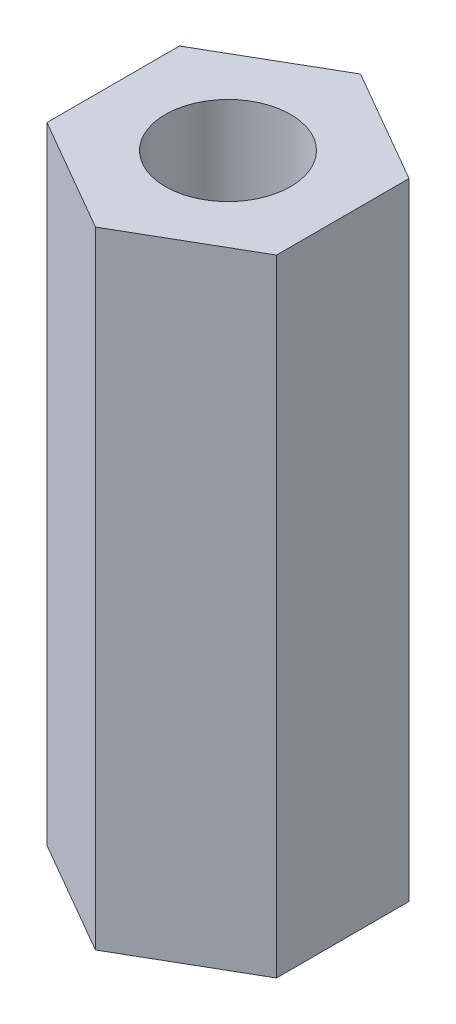
ISO-10303-21;
HEADER;
FILE_DESCRIPTION(('STEP AP214'),'2;1');
FILE_NAME('part.step','',(''),(''),'','','');
FILE_SCHEMA(('AUTOMOTIVE_DESIGN { 1 0 10303 214 1 1 1 1 }'));
ENDSEC;
DATA;
#1=APPLICATION_CONTEXT('core data for automotive mechanical design processes');
#2=APPLICATION_PROTOCOL_DEFINITION('international standard','automotive_design',2000,#1);
#3=PRODUCT_CONTEXT('',#1,'mechanical');
#4=PRODUCT('Part','Part','',(#3));
#5=PRODUCT_RELATED_PRODUCT_CATEGORY('part','',(#4));
#6=PRODUCT_DEFINITION_FORMATION('','',#4);
#7=PRODUCT_DEFINITION_CONTEXT('part definition',#1,'design');
#8=PRODUCT_DEFINITION('design','',#6,#7);
#9=PRODUCT_DEFINITION_SHAPE('','',#8);
#10=(LENGTH_UNIT() NAMED_UNIT(*) SI_UNIT(.MILLI.,.METRE.));
#11=(NAMED_UNIT(*) PLANE_ANGLE_UNIT() SI_UNIT($,.RADIAN.));
#12=(NAMED_UNIT(*) SI_UNIT($,.STERADIAN.) SOLID_ANGLE_UNIT());
#13=UNCERTAINTY_MEASURE_WITH_UNIT(LENGTH_MEASURE(1.E-05),#10,'distance_accuracy_value','');
#14=(GEOMETRIC_REPRESENTATION_CONTEXT(3) GLOBAL_UNCERTAINTY_ASSIGNED_CONTEXT((#13)) GLOBAL_UNIT_ASSIGNED_CONTEXT((#10,
#11,#12)) REPRESENTATION_CONTEXT('',''));
#15=CARTESIAN_POINT('',(0.,0.,0.));
#16=DIRECTION('',(0.,0.,1.));
#17=DIRECTION('',(1.,0.,0.));
#18=AXIS2_PLACEMENT_3D('',#15,#16,#17);
#19=CARTESIAN_POINT('',(0.,15.,0.));
#20=DIRECTION('',(0.,1.,0.));
#21=DIRECTION('',(0.,0.,1.));
#22=AXIS2_PLACEMENT_3D('',#19,#20,#21);
#23=PLANE('',#22);
#24=DIRECTION('',(-0.866025403784442,0.,-0.499999999999995));
#25=VECTOR('',#24,1.);
#26=CARTESIAN_POINT('',(2.74999999999998,15.,-1.5877132402715));
#27=LINE('',#26,#25);
#28=CARTESIAN_POINT('',(2.74999999999998,15.,-1.5877132402715));
#29=VERTEX_POINT('',#28);
#30=CARTESIAN_POINT('',(0.,15.,-3.17542648054294));
#31=VERTEX_POINT('',#30);
#32=EDGE_CURVE('E132',#29,#31,#27,.T.);
#33=ORIENTED_EDGE('',*,*,#32,.T.);
#34=DIRECTION('',(-0.866025403784438,0.,0.500000000000001));
#35=VECTOR('',#34,1.);
#36=CARTESIAN_POINT('',(0.,15.,-3.17542648054294));
#37=LINE('',#36,#35);
#38=CARTESIAN_POINT('',(-2.75000000000001,15.,-1.58771324027147));
#39=VERTEX_POINT('',#38);
#40=EDGE_CURVE('E90',#31,#39,#37,.T.);
#41=ORIENTED_EDGE('',*,*,#40,.T.);
#42=DIRECTION('',(0.,0.,1.));
#43=VECTOR('',#42,1.);
#44=CARTESIAN_POINT('',(-2.75000000000001,15.,-1.58771324027147));
#45=LINE('',#44,#43);
#46=CARTESIAN_POINT('',(-2.74999999999999,15.,1.58771324027148));
#47=VERTEX_POINT('',#46);
#48=EDGE_CURVE('E103',#39,#47,#45,.T.);
#49=ORIENTED_EDGE('',*,*,#48,.T.);
#50=DIRECTION('',(0.866025403784441,0.,0.499999999999995));
#51=VECTOR('',#50,1.);
#52=CARTESIAN_POINT('',(-2.74999999999999,15.,1.58771324027148));
#53=LINE('',#52,#51);
#54=CARTESIAN_POINT('',(0.,15.,3.17542648054294));
#55=VERTEX_POINT('',#54);
#56=EDGE_CURVE('E97',#47,#55,#53,.T.);
#57=ORIENTED_EDGE('',*,*,#56,.T.);
#58=DIRECTION('',(0.866025403784435,0.,-0.500000000000007));
#59=VECTOR('',#58,1.);
#60=CARTESIAN_POINT('',(0.,15.,3.17542648054294));
#61=LINE('',#60,#59);
#62=CARTESIAN_POINT('',(2.75000000000002,15.,1.58771324027145));
#63=VERTEX_POINT('',#62);
#64=EDGE_CURVE('E101',#55,#63,#61,.T.);
#65=ORIENTED_EDGE('',*,*,#64,.T.);
#66=DIRECTION('',(0.,0.,-1.));
#67=VECTOR('',#66,1.);
#68=CARTESIAN_POINT('',(2.75000000000002,15.,1.58771324027145));
#69=LINE('',#68,#67);
#70=EDGE_CURVE('E53',#63,#29,#69,.T.);
#71=ORIENTED_EDGE('',*,*,#70,.T.);
#72=EDGE_LOOP('',(#33,#41,#49,#57,#65,#71));
#73=FACE_BOUND('',#72,.T.);
#74=CARTESIAN_POINT('',(0.,15.,0.));
#75=DIRECTION('',(0.,1.,0.));
#76=DIRECTION('',(0.,0.,1.));
#77=AXIS2_PLACEMENT_3D('',#74,#75,#76);
#78=CIRCLE('',#77,1.5);
#79=CARTESIAN_POINT('',(0.,15.,1.5));
#80=VERTEX_POINT('',#79);
#81=EDGE_CURVE('E125',#80,#80,#78,.T.);
#82=ORIENTED_EDGE('',*,*,#81,.F.);
#83=EDGE_LOOP('',(#82));
#84=FACE_BOUND('',#83,.T.);
#85=ADVANCED_FACE('F36',(#73,#84),#23,.T.);
#86=CARTESIAN_POINT('',(0.,0.,0.));
#87=DIRECTION('',(0.,1.,0.));
#88=DIRECTION('',(0.,0.,1.));
#89=AXIS2_PLACEMENT_3D('',#86,#87,#88);
#90=PLANE('',#89);
#91=DIRECTION('',(-0.866025403784442,0.,-0.499999999999995));
#92=VECTOR('',#91,1.);
#93=CARTESIAN_POINT('',(2.74999999999998,0.,-1.5877132402715));
#94=LINE('',#93,#92);
#95=CARTESIAN_POINT('',(2.74999999999998,0.,-1.5877132402715));
#96=VERTEX_POINT('',#95);
#97=CARTESIAN_POINT('',(0.,0.,-3.17542648054294));
#98=VERTEX_POINT('',#97);
#99=EDGE_CURVE('E121',#96,#98,#94,.T.);
#100=ORIENTED_EDGE('',*,*,#99,.F.);
#101=DIRECTION('',(0.,0.,-1.));
#102=VECTOR('',#101,1.);
#103=CARTESIAN_POINT('',(2.75000000000002,0.,1.58771324027145));
#104=LINE('',#103,#102);
#105=CARTESIAN_POINT('',(2.75000000000002,0.,1.58771324027145));
#106=VERTEX_POINT('',#105);
#107=EDGE_CURVE('E82',#106,#96,#104,.T.);
#108=ORIENTED_EDGE('',*,*,#107,.F.);
#109=DIRECTION('',(0.866025403784435,0.,-0.500000000000007));
#110=VECTOR('',#109,1.);
#111=CARTESIAN_POINT('',(0.,0.,3.17542648054294));
#112=LINE('',#111,#110);
#113=CARTESIAN_POINT('',(0.,0.,3.17542648054294));
#114=VERTEX_POINT('',#113);
#115=EDGE_CURVE('E76',#114,#106,#112,.T.);
#116=ORIENTED_EDGE('',*,*,#115,.F.);
#117=DIRECTION('',(0.866025403784441,0.,0.499999999999995));
#118=VECTOR('',#117,1.);
#119=CARTESIAN_POINT('',(-2.74999999999999,0.,1.58771324027148));
#120=LINE('',#119,#118);
#121=CARTESIAN_POINT('',(-2.74999999999999,0.,1.58771324027148));
#122=VERTEX_POINT('',#121);
#123=EDGE_CURVE('E111',#122,#114,#120,.T.);
#124=ORIENTED_EDGE('',*,*,#123,.F.);
#125=DIRECTION('',(0.,0.,1.));
#126=VECTOR('',#125,1.);
#127=CARTESIAN_POINT('',(-2.75000000000001,0.,-1.58771324027147));
#128=LINE('',#127,#126);
#129=CARTESIAN_POINT('',(-2.75000000000001,0.,-1.58771324027147));
#130=VERTEX_POINT('',#129);
#131=EDGE_CURVE('E127',#130,#122,#128,.T.);
#132=ORIENTED_EDGE('',*,*,#131,.F.);
#133=DIRECTION('',(-0.866025403784438,0.,0.500000000000001));
#134=VECTOR('',#133,1.);
#135=CARTESIAN_POINT('',(0.,0.,-3.17542648054294));
#136=LINE('',#135,#134);
#137=EDGE_CURVE('E124',#98,#130,#136,.T.);
#138=ORIENTED_EDGE('',*,*,#137,.F.);
#139=EDGE_LOOP('',(#100,#108,#116,#124,#132,#138));
#140=FACE_BOUND('',#139,.T.);
#141=CARTESIAN_POINT('',(0.,0.,0.));
#142=DIRECTION('',(0.,1.,0.));
#143=DIRECTION('',(0.,0.,1.));
#144=AXIS2_PLACEMENT_3D('',#141,#142,#143);
#145=CIRCLE('',#144,1.5);
#146=CARTESIAN_POINT('',(0.,0.,1.5));
#147=VERTEX_POINT('',#146);
#148=EDGE_CURVE('E225',#147,#147,#145,.T.);
#149=ORIENTED_EDGE('',*,*,#148,.T.);
#150=EDGE_LOOP('',(#149));
#151=FACE_BOUND('',#150,.T.);
#152=ADVANCED_FACE('F141',(#140,#151),#90,.F.);
#153=CARTESIAN_POINT('',(2.74999999999998,15.,-1.5877132402715));
#154=DIRECTION('',(-0.499999999999995,0.,0.866025403784442));
#155=DIRECTION('',(0.866025403784442,0.,0.499999999999995));
#156=AXIS2_PLACEMENT_3D('',#153,#154,#155);
#157=PLANE('',#156);
#158=ORIENTED_EDGE('',*,*,#99,.T.);
#159=DIRECTION('',(0.,-1.,0.));
#160=VECTOR('',#159,1.);
#161=CARTESIAN_POINT('',(0.,15.,-3.17542648054294));
#162=LINE('',#161,#160);
#163=EDGE_CURVE('E11',#31,#98,#162,.T.);
#164=ORIENTED_EDGE('',*,*,#163,.F.);
#165=ORIENTED_EDGE('',*,*,#32,.F.);
#166=DIRECTION('',(0.,-1.,0.));
#167=VECTOR('',#166,1.);
#168=CARTESIAN_POINT('',(2.74999999999998,15.,-1.5877132402715));
#169=LINE('',#168,#167);
#170=EDGE_CURVE('E117',#29,#96,#169,.T.);
#171=ORIENTED_EDGE('',*,*,#170,.T.);
#172=EDGE_LOOP('',(#158,#164,#165,#171));
#173=FACE_BOUND('',#172,.T.);
#174=ADVANCED_FACE('F38',(#173),#157,.F.);
#175=CARTESIAN_POINT('',(0.,15.,-3.17542648054294));
#176=DIRECTION('',(0.500000000000001,0.,0.866025403784438));
#177=DIRECTION('',(0.866025403784438,0.,-0.500000000000001));
#178=AXIS2_PLACEMENT_3D('',#175,#176,#177);
#179=PLANE('',#178);
#180=ORIENTED_EDGE('',*,*,#137,.T.);
#181=DIRECTION('',(0.,-1.,0.));
#182=VECTOR('',#181,1.);
#183=CARTESIAN_POINT('',(-2.75000000000001,15.,-1.58771324027147));
#184=LINE('',#183,#182);
#185=EDGE_CURVE('E45',#39,#130,#184,.T.);
#186=ORIENTED_EDGE('',*,*,#185,.F.);
#187=ORIENTED_EDGE('',*,*,#40,.F.);
#188=ORIENTED_EDGE('',*,*,#163,.T.);
#189=EDGE_LOOP('',(#180,#186,#187,#188));
#190=FACE_BOUND('',#189,.T.);
#191=ADVANCED_FACE('F166',(#190),#179,.F.);
#192=CARTESIAN_POINT('',(-2.75000000000001,15.,-1.58771324027147));
#193=DIRECTION('',(1.,0.,0.));
#194=DIRECTION('',(0.,0.,-1.));
#195=AXIS2_PLACEMENT_3D('',#192,#193,#194);
#196=PLANE('',#195);
#197=ORIENTED_EDGE('',*,*,#131,.T.);
#198=DIRECTION('',(0.,-1.,0.));
#199=VECTOR('',#198,1.);
#200=CARTESIAN_POINT('',(-2.74999999999999,15.,1.58771324027148));
#201=LINE('',#200,#199);
#202=EDGE_CURVE('E112',#47,#122,#201,.T.);
#203=ORIENTED_EDGE('',*,*,#202,.F.);
#204=ORIENTED_EDGE('',*,*,#48,.F.);
#205=ORIENTED_EDGE('',*,*,#185,.T.);
#206=EDGE_LOOP('',(#197,#203,#204,#205));
#207=FACE_BOUND('',#206,.T.);
#208=ADVANCED_FACE('F138',(#207),#196,.F.);
#209=CARTESIAN_POINT('',(-2.74999999999999,15.,1.58771324027148));
#210=DIRECTION('',(0.499999999999995,0.,-0.866025403784441));
#211=DIRECTION('',(-0.866025403784441,0.,-0.499999999999995));
#212=AXIS2_PLACEMENT_3D('',#209,#210,#211);
#213=PLANE('',#212);
#214=ORIENTED_EDGE('',*,*,#123,.T.);
#215=DIRECTION('',(0.,-1.,0.));
#216=VECTOR('',#215,1.);
#217=CARTESIAN_POINT('',(0.,15.,3.17542648054294));
#218=LINE('',#217,#216);
#219=EDGE_CURVE('E108',#55,#114,#218,.T.);
#220=ORIENTED_EDGE('',*,*,#219,.F.);
#221=ORIENTED_EDGE('',*,*,#56,.F.);
#222=ORIENTED_EDGE('',*,*,#202,.T.);
#223=EDGE_LOOP('',(#214,#220,#221,#222));
#224=FACE_BOUND('',#223,.T.);
#225=ADVANCED_FACE('F109',(#224),#213,.F.);
#226=CARTESIAN_POINT('',(0.,15.,3.17542648054294));
#227=DIRECTION('',(-0.500000000000007,0.,-0.866025403784434));
#228=DIRECTION('',(-0.866025403784435,0.,0.500000000000007));
#229=AXIS2_PLACEMENT_3D('',#226,#227,#228);
#230=PLANE('',#229);
#231=ORIENTED_EDGE('',*,*,#115,.T.);
#232=DIRECTION('',(0.,-1.,0.));
#233=VECTOR('',#232,1.);
#234=CARTESIAN_POINT('',(2.75000000000002,15.,1.58771324027145));
#235=LINE('',#234,#233);
#236=EDGE_CURVE('E113',#63,#106,#235,.T.);
#237=ORIENTED_EDGE('',*,*,#236,.F.);
#238=ORIENTED_EDGE('',*,*,#64,.F.);
#239=ORIENTED_EDGE('',*,*,#219,.T.);
#240=EDGE_LOOP('',(#231,#237,#238,#239));
#241=FACE_BOUND('',#240,.T.);
#242=ADVANCED_FACE('F115',(#241),#230,.F.);
#243=CARTESIAN_POINT('',(2.75000000000002,15.,1.58771324027145));
#244=DIRECTION('',(-1.,0.,0.));
#245=DIRECTION('',(0.,0.,1.));
#246=AXIS2_PLACEMENT_3D('',#243,#244,#245);
#247=PLANE('',#246);
#248=ORIENTED_EDGE('',*,*,#107,.T.);
#249=ORIENTED_EDGE('',*,*,#170,.F.);
#250=ORIENTED_EDGE('',*,*,#70,.F.);
#251=ORIENTED_EDGE('',*,*,#236,.T.);
#252=EDGE_LOOP('',(#248,#249,#250,#251));
#253=FACE_BOUND('',#252,.T.);
#254=ADVANCED_FACE('F146',(#253),#247,.F.);
#255=CARTESIAN_POINT('',(0.,15.,0.));
#256=DIRECTION('',(0.,-1.,0.));
#257=DIRECTION('',(0.,0.,-1.));
#258=AXIS2_PLACEMENT_3D('',#255,#256,#257);
#259=CYLINDRICAL_SURFACE('',#258,1.5);
#260=ORIENTED_EDGE('',*,*,#81,.T.);
#261=EDGE_LOOP('',(#260));
#262=FACE_BOUND('',#261,.T.);
#263=ORIENTED_EDGE('',*,*,#148,.F.);
#264=EDGE_LOOP('',(#263));
#265=FACE_BOUND('',#264,.T.);
#266=ADVANCED_FACE('F148',(#262,#265),#259,.F.);
#267=CLOSED_SHELL('',(#85,#152,#174,#191,#208,#225,#242,#254,#266));
#268=MANIFOLD_SOLID_BREP('B2',#267);
#269=ADVANCED_BREP_SHAPE_REPRESENTATION('',(#18,#268),#14);
#270=SHAPE_DEFINITION_REPRESENTATION(#9,#269);
ENDSEC;
END-ISO-10303-21;
